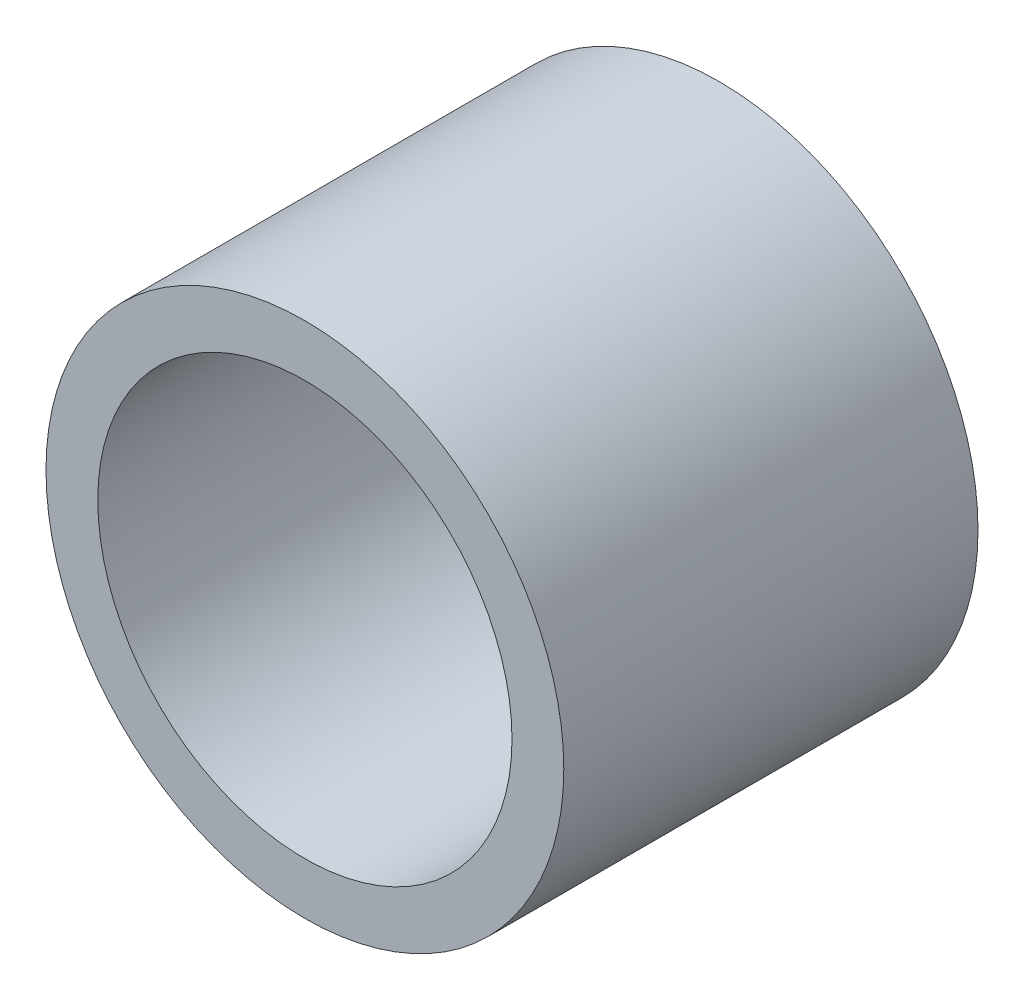
ISO-10303-21;
HEADER;
FILE_DESCRIPTION(('STEP AP214'),'2;1');
FILE_NAME('part.step','',(''),(''),'','','');
FILE_SCHEMA(('AUTOMOTIVE_DESIGN { 1 0 10303 214 1 1 1 1 }'));
ENDSEC;
DATA;
#1=APPLICATION_CONTEXT('core data for automotive mechanical design processes');
#2=APPLICATION_PROTOCOL_DEFINITION('international standard','automotive_design',2000,#1);
#3=PRODUCT_CONTEXT('',#1,'mechanical');
#4=PRODUCT('Part','Part','',(#3));
#5=PRODUCT_RELATED_PRODUCT_CATEGORY('part','',(#4));
#6=PRODUCT_DEFINITION_FORMATION('','',#4);
#7=PRODUCT_DEFINITION_CONTEXT('part definition',#1,'design');
#8=PRODUCT_DEFINITION('design','',#6,#7);
#9=PRODUCT_DEFINITION_SHAPE('','',#8);
#10=(LENGTH_UNIT() NAMED_UNIT(*) SI_UNIT(.MILLI.,.METRE.));
#11=(NAMED_UNIT(*) PLANE_ANGLE_UNIT() SI_UNIT($,.RADIAN.));
#12=(NAMED_UNIT(*) SI_UNIT($,.STERADIAN.) SOLID_ANGLE_UNIT());
#13=UNCERTAINTY_MEASURE_WITH_UNIT(LENGTH_MEASURE(1.E-05),#10,'distance_accuracy_value','');
#14=(GEOMETRIC_REPRESENTATION_CONTEXT(3) GLOBAL_UNCERTAINTY_ASSIGNED_CONTEXT((#13)) GLOBAL_UNIT_ASSIGNED_CONTEXT((#10,
#11,#12)) REPRESENTATION_CONTEXT('',''));
#15=CARTESIAN_POINT('',(0.,0.,0.));
#16=DIRECTION('',(0.,0.,1.));
#17=DIRECTION('',(1.,0.,0.));
#18=AXIS2_PLACEMENT_3D('',#15,#16,#17);
#19=CARTESIAN_POINT('',(0.,0.,8.));
#20=DIRECTION('',(0.,0.,-1.));
#21=DIRECTION('',(-1.,0.,0.));
#22=AXIS2_PLACEMENT_3D('',#19,#20,#21);
#23=CYLINDRICAL_SURFACE('',#22,4.);
#24=CARTESIAN_POINT('',(0.,0.,0.));
#25=DIRECTION('',(0.,0.,-1.));
#26=DIRECTION('',(-1.,0.,0.));
#27=AXIS2_PLACEMENT_3D('',#24,#25,#26);
#28=CIRCLE('',#27,4.);
#29=CARTESIAN_POINT('',(-4.,0.,0.));
#30=VERTEX_POINT('',#29);
#31=EDGE_CURVE('E27',#30,#30,#28,.T.);
#32=ORIENTED_EDGE('',*,*,#31,.T.);
#33=EDGE_LOOP('',(#32));
#34=FACE_BOUND('',#33,.T.);
#35=CARTESIAN_POINT('',(0.,0.,8.));
#36=DIRECTION('',(0.,0.,-1.));
#37=DIRECTION('',(-1.,0.,0.));
#38=AXIS2_PLACEMENT_3D('',#35,#36,#37);
#39=CIRCLE('',#38,4.);
#40=CARTESIAN_POINT('',(-4.,0.,8.));
#41=VERTEX_POINT('',#40);
#42=EDGE_CURVE('E18',#41,#41,#39,.T.);
#43=ORIENTED_EDGE('',*,*,#42,.F.);
#44=EDGE_LOOP('',(#43));
#45=FACE_BOUND('',#44,.T.);
#46=ADVANCED_FACE('F15',(#34,#45),#23,.F.);
#47=CARTESIAN_POINT('',(0.,0.,8.));
#48=DIRECTION('',(0.,0.,1.));
#49=DIRECTION('',(1.,0.,0.));
#50=AXIS2_PLACEMENT_3D('',#47,#48,#49);
#51=PLANE('',#50);
#52=ORIENTED_EDGE('',*,*,#42,.T.);
#53=EDGE_LOOP('',(#52));
#54=FACE_BOUND('',#53,.T.);
#55=CARTESIAN_POINT('',(0.,0.,8.));
#56=DIRECTION('',(0.,0.,-1.));
#57=DIRECTION('',(-1.,0.,0.));
#58=AXIS2_PLACEMENT_3D('',#55,#56,#57);
#59=CIRCLE('',#58,5.);
#60=CARTESIAN_POINT('',(-5.,0.,8.));
#61=VERTEX_POINT('',#60);
#62=EDGE_CURVE('E22',#61,#61,#59,.T.);
#63=ORIENTED_EDGE('',*,*,#62,.F.);
#64=EDGE_LOOP('',(#63));
#65=FACE_BOUND('',#64,.T.);
#66=ADVANCED_FACE('F35',(#54,#65),#51,.T.);
#67=CARTESIAN_POINT('',(0.,0.,0.));
#68=DIRECTION('',(0.,0.,1.));
#69=DIRECTION('',(1.,0.,0.));
#70=AXIS2_PLACEMENT_3D('',#67,#68,#69);
#71=PLANE('',#70);
#72=ORIENTED_EDGE('',*,*,#31,.F.);
#73=EDGE_LOOP('',(#72));
#74=FACE_BOUND('',#73,.T.);
#75=CARTESIAN_POINT('',(0.,0.,0.));
#76=DIRECTION('',(0.,0.,-1.));
#77=DIRECTION('',(-1.,0.,0.));
#78=AXIS2_PLACEMENT_3D('',#75,#76,#77);
#79=CIRCLE('',#78,5.);
#80=CARTESIAN_POINT('',(-5.,0.,0.));
#81=VERTEX_POINT('',#80);
#82=EDGE_CURVE('E10',#81,#81,#79,.F.);
#83=ORIENTED_EDGE('',*,*,#82,.F.);
#84=EDGE_LOOP('',(#83));
#85=FACE_BOUND('',#84,.T.);
#86=ADVANCED_FACE('F43',(#74,#85),#71,.F.);
#87=CARTESIAN_POINT('',(0.,0.,8.));
#88=DIRECTION('',(0.,0.,-1.));
#89=DIRECTION('',(-1.,0.,0.));
#90=AXIS2_PLACEMENT_3D('',#87,#88,#89);
#91=CYLINDRICAL_SURFACE('',#90,5.);
#92=ORIENTED_EDGE('',*,*,#82,.T.);
#93=EDGE_LOOP('',(#92));
#94=FACE_BOUND('',#93,.T.);
#95=ORIENTED_EDGE('',*,*,#62,.T.);
#96=EDGE_LOOP('',(#95));
#97=FACE_BOUND('',#96,.T.);
#98=ADVANCED_FACE('F44',(#94,#97),#91,.T.);
#99=CLOSED_SHELL('',(#46,#66,#86,#98));
#100=MANIFOLD_SOLID_BREP('B1',#99);
#101=ADVANCED_BREP_SHAPE_REPRESENTATION('',(#18,#100),#14);
#102=SHAPE_DEFINITION_REPRESENTATION(#9,#101);
ENDSEC;
END-ISO-10303-21;
